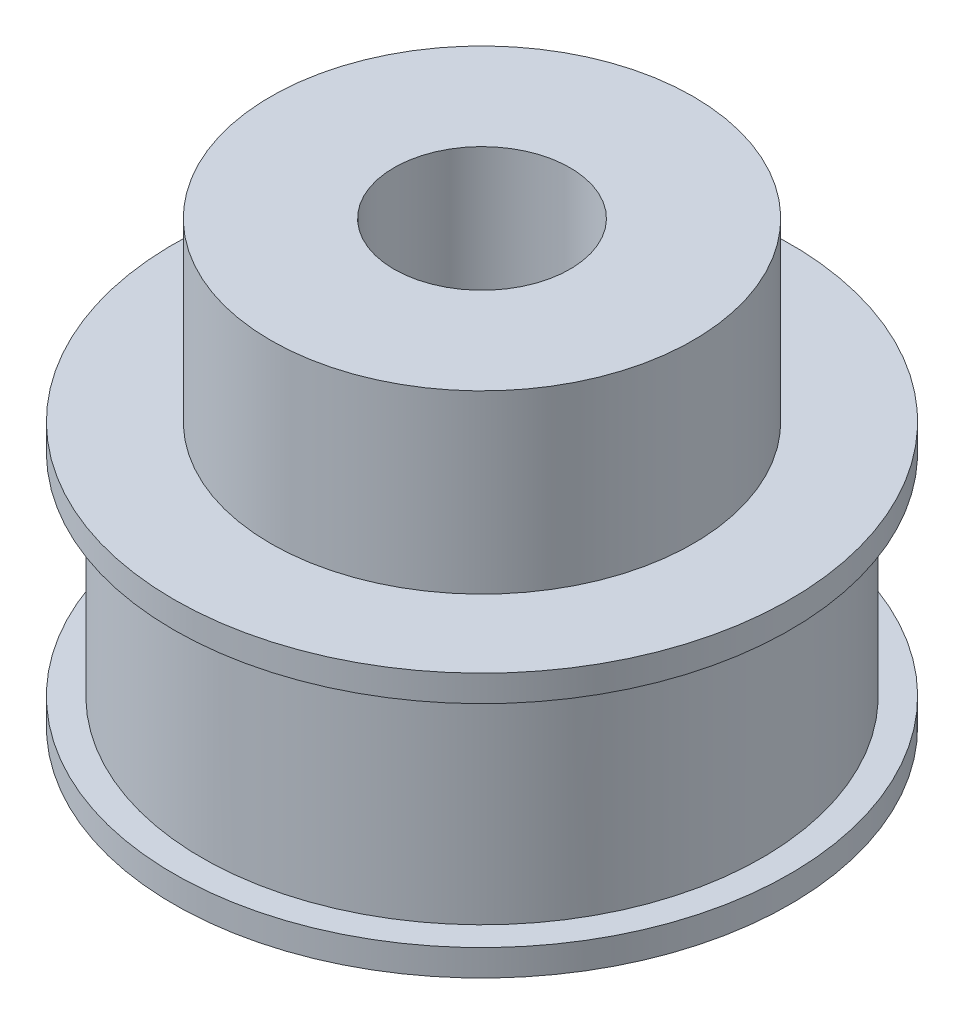
ISO-10303-21;
HEADER;
FILE_DESCRIPTION(('STEP AP214'),'2;1');
FILE_NAME('part.step','',(''),(''),'','','');
FILE_SCHEMA(('AUTOMOTIVE_DESIGN { 1 0 10303 214 1 1 1 1 }'));
ENDSEC;
DATA;
#1=APPLICATION_CONTEXT('core data for automotive mechanical design processes');
#2=APPLICATION_PROTOCOL_DEFINITION('international standard','automotive_design',2000,#1);
#3=PRODUCT_CONTEXT('',#1,'mechanical');
#4=PRODUCT('Part','Part','',(#3));
#5=PRODUCT_RELATED_PRODUCT_CATEGORY('part','',(#4));
#6=PRODUCT_DEFINITION_FORMATION('','',#4);
#7=PRODUCT_DEFINITION_CONTEXT('part definition',#1,'design');
#8=PRODUCT_DEFINITION('design','',#6,#7);
#9=PRODUCT_DEFINITION_SHAPE('','',#8);
#10=(LENGTH_UNIT() NAMED_UNIT(*) SI_UNIT(.MILLI.,.METRE.));
#11=(NAMED_UNIT(*) PLANE_ANGLE_UNIT() SI_UNIT($,.RADIAN.));
#12=(NAMED_UNIT(*) SI_UNIT($,.STERADIAN.) SOLID_ANGLE_UNIT());
#13=UNCERTAINTY_MEASURE_WITH_UNIT(LENGTH_MEASURE(1.E-05),#10,'distance_accuracy_value','');
#14=(GEOMETRIC_REPRESENTATION_CONTEXT(3) GLOBAL_UNCERTAINTY_ASSIGNED_CONTEXT((#13)) GLOBAL_UNIT_ASSIGNED_CONTEXT((#10,
#11,#12)) REPRESENTATION_CONTEXT('',''));
#15=CARTESIAN_POINT('',(0.,0.,0.));
#16=DIRECTION('',(0.,0.,1.));
#17=DIRECTION('',(1.,0.,0.));
#18=AXIS2_PLACEMENT_3D('',#15,#16,#17);
#19=CARTESIAN_POINT('',(0.,15.,0.));
#20=DIRECTION('',(0.,-1.,0.));
#21=DIRECTION('',(0.,0.,-1.));
#22=AXIS2_PLACEMENT_3D('',#19,#20,#21);
#23=CYLINDRICAL_SURFACE('',#22,15.915);
#24=CARTESIAN_POINT('',(0.,1.5,0.));
#25=DIRECTION('',(0.,-1.,0.));
#26=DIRECTION('',(0.,0.,-1.));
#27=AXIS2_PLACEMENT_3D('',#24,#25,#26);
#28=CIRCLE('',#27,15.915);
#29=CARTESIAN_POINT('',(0.,1.5,-15.915));
#30=VERTEX_POINT('',#29);
#31=EDGE_CURVE('E64',#30,#30,#28,.T.);
#32=ORIENTED_EDGE('',*,*,#31,.F.);
#33=EDGE_LOOP('',(#32));
#34=FACE_BOUND('',#33,.T.);
#35=CARTESIAN_POINT('',(0.,13.5,0.));
#36=DIRECTION('',(0.,1.,0.));
#37=DIRECTION('',(0.,0.,1.));
#38=AXIS2_PLACEMENT_3D('',#35,#36,#37);
#39=CIRCLE('',#38,15.915);
#40=CARTESIAN_POINT('',(0.,13.5,15.915));
#41=VERTEX_POINT('',#40);
#42=EDGE_CURVE('E76',#41,#41,#39,.T.);
#43=ORIENTED_EDGE('',*,*,#42,.F.);
#44=EDGE_LOOP('',(#43));
#45=FACE_BOUND('',#44,.T.);
#46=ADVANCED_FACE('F37',(#34,#45),#23,.T.);
#47=CARTESIAN_POINT('',(0.,15.,0.));
#48=DIRECTION('',(0.,1.,0.));
#49=DIRECTION('',(0.,0.,1.));
#50=AXIS2_PLACEMENT_3D('',#47,#48,#49);
#51=PLANE('',#50);
#52=CARTESIAN_POINT('',(0.,15.,0.));
#53=DIRECTION('',(0.,1.,0.));
#54=DIRECTION('',(0.,0.,1.));
#55=AXIS2_PLACEMENT_3D('',#52,#53,#54);
#56=CIRCLE('',#55,12.);
#57=CARTESIAN_POINT('',(0.,15.,12.));
#58=VERTEX_POINT('',#57);
#59=EDGE_CURVE('E41',#58,#58,#56,.T.);
#60=ORIENTED_EDGE('',*,*,#59,.F.);
#61=EDGE_LOOP('',(#60));
#62=FACE_BOUND('',#61,.T.);
#63=CARTESIAN_POINT('',(0.,15.,0.));
#64=DIRECTION('',(0.,1.,0.));
#65=DIRECTION('',(0.,0.,1.));
#66=AXIS2_PLACEMENT_3D('',#63,#64,#65);
#67=CIRCLE('',#66,17.5);
#68=CARTESIAN_POINT('',(0.,15.,17.5));
#69=VERTEX_POINT('',#68);
#70=EDGE_CURVE('E72',#69,#69,#67,.T.);
#71=ORIENTED_EDGE('',*,*,#70,.T.);
#72=EDGE_LOOP('',(#71));
#73=FACE_BOUND('',#72,.T.);
#74=ADVANCED_FACE('F88',(#62,#73),#51,.T.);
#75=CARTESIAN_POINT('',(0.,0.,0.));
#76=DIRECTION('',(0.,1.,0.));
#77=DIRECTION('',(0.,0.,1.));
#78=AXIS2_PLACEMENT_3D('',#75,#76,#77);
#79=PLANE('',#78);
#80=CARTESIAN_POINT('',(0.,0.,0.));
#81=DIRECTION('',(0.,1.,0.));
#82=DIRECTION('',(0.,0.,1.));
#83=AXIS2_PLACEMENT_3D('',#80,#81,#82);
#84=CIRCLE('',#83,5.);
#85=CARTESIAN_POINT('',(0.,0.,5.));
#86=VERTEX_POINT('',#85);
#87=EDGE_CURVE('E50',#86,#86,#84,.T.);
#88=ORIENTED_EDGE('',*,*,#87,.T.);
#89=EDGE_LOOP('',(#88));
#90=FACE_BOUND('',#89,.T.);
#91=CARTESIAN_POINT('',(0.,0.,0.));
#92=DIRECTION('',(0.,-1.,0.));
#93=DIRECTION('',(0.,0.,-1.));
#94=AXIS2_PLACEMENT_3D('',#91,#92,#93);
#95=CIRCLE('',#94,17.5);
#96=CARTESIAN_POINT('',(0.,0.,-17.5));
#97=VERTEX_POINT('',#96);
#98=EDGE_CURVE('E60',#97,#97,#95,.T.);
#99=ORIENTED_EDGE('',*,*,#98,.T.);
#100=EDGE_LOOP('',(#99));
#101=FACE_BOUND('',#100,.T.);
#102=ADVANCED_FACE('F39',(#90,#101),#79,.F.);
#103=CARTESIAN_POINT('',(0.,25.,0.));
#104=DIRECTION('',(0.,-1.,0.));
#105=DIRECTION('',(0.,0.,-1.));
#106=AXIS2_PLACEMENT_3D('',#103,#104,#105);
#107=CYLINDRICAL_SURFACE('',#106,12.);
#108=CARTESIAN_POINT('',(0.,25.,0.));
#109=DIRECTION('',(0.,1.,0.));
#110=DIRECTION('',(0.,0.,1.));
#111=AXIS2_PLACEMENT_3D('',#108,#109,#110);
#112=CIRCLE('',#111,12.);
#113=CARTESIAN_POINT('',(0.,25.,12.));
#114=VERTEX_POINT('',#113);
#115=EDGE_CURVE('E10',#114,#114,#112,.T.);
#116=ORIENTED_EDGE('',*,*,#115,.F.);
#117=EDGE_LOOP('',(#116));
#118=FACE_BOUND('',#117,.T.);
#119=ORIENTED_EDGE('',*,*,#59,.T.);
#120=EDGE_LOOP('',(#119));
#121=FACE_BOUND('',#120,.T.);
#122=ADVANCED_FACE('F107',(#118,#121),#107,.T.);
#123=CARTESIAN_POINT('',(0.,25.,0.));
#124=DIRECTION('',(0.,1.,0.));
#125=DIRECTION('',(0.,0.,1.));
#126=AXIS2_PLACEMENT_3D('',#123,#124,#125);
#127=PLANE('',#126);
#128=CARTESIAN_POINT('',(0.,25.,0.));
#129=DIRECTION('',(0.,1.,0.));
#130=DIRECTION('',(0.,0.,1.));
#131=AXIS2_PLACEMENT_3D('',#128,#129,#130);
#132=CIRCLE('',#131,5.);
#133=CARTESIAN_POINT('',(0.,25.,5.));
#134=VERTEX_POINT('',#133);
#135=EDGE_CURVE('E55',#134,#134,#132,.T.);
#136=ORIENTED_EDGE('',*,*,#135,.F.);
#137=EDGE_LOOP('',(#136));
#138=FACE_BOUND('',#137,.T.);
#139=ORIENTED_EDGE('',*,*,#115,.T.);
#140=EDGE_LOOP('',(#139));
#141=FACE_BOUND('',#140,.T.);
#142=ADVANCED_FACE('F103',(#138,#141),#127,.T.);
#143=CARTESIAN_POINT('',(0.,-0.999999999999997,0.));
#144=DIRECTION('',(0.,1.,0.));
#145=DIRECTION('',(0.,0.,1.));
#146=AXIS2_PLACEMENT_3D('',#143,#144,#145);
#147=CYLINDRICAL_SURFACE('',#146,5.);
#148=ORIENTED_EDGE('',*,*,#135,.T.);
#149=EDGE_LOOP('',(#148));
#150=FACE_BOUND('',#149,.T.);
#151=ORIENTED_EDGE('',*,*,#87,.F.);
#152=EDGE_LOOP('',(#151));
#153=FACE_BOUND('',#152,.T.);
#154=ADVANCED_FACE('F100',(#150,#153),#147,.F.);
#155=CARTESIAN_POINT('',(0.,1.5,0.));
#156=DIRECTION('',(0.,-1.,0.));
#157=DIRECTION('',(0.,0.,-1.));
#158=AXIS2_PLACEMENT_3D('',#155,#156,#157);
#159=CYLINDRICAL_SURFACE('',#158,17.5);
#160=CARTESIAN_POINT('',(0.,1.5,0.));
#161=DIRECTION('',(0.,-1.,0.));
#162=DIRECTION('',(0.,0.,-1.));
#163=AXIS2_PLACEMENT_3D('',#160,#161,#162);
#164=CIRCLE('',#163,17.5);
#165=CARTESIAN_POINT('',(0.,1.5,-17.5));
#166=VERTEX_POINT('',#165);
#167=EDGE_CURVE('E59',#166,#166,#164,.T.);
#168=ORIENTED_EDGE('',*,*,#167,.T.);
#169=EDGE_LOOP('',(#168));
#170=FACE_BOUND('',#169,.T.);
#171=ORIENTED_EDGE('',*,*,#98,.F.);
#172=EDGE_LOOP('',(#171));
#173=FACE_BOUND('',#172,.T.);
#174=ADVANCED_FACE('F98',(#170,#173),#159,.T.);
#175=CARTESIAN_POINT('',(0.,1.5,0.));
#176=DIRECTION('',(0.,-1.,0.));
#177=DIRECTION('',(0.,0.,-1.));
#178=AXIS2_PLACEMENT_3D('',#175,#176,#177);
#179=PLANE('',#178);
#180=ORIENTED_EDGE('',*,*,#31,.T.);
#181=EDGE_LOOP('',(#180));
#182=FACE_BOUND('',#181,.T.);
#183=ORIENTED_EDGE('',*,*,#167,.F.);
#184=EDGE_LOOP('',(#183));
#185=FACE_BOUND('',#184,.T.);
#186=ADVANCED_FACE('F122',(#182,#185),#179,.F.);
#187=CARTESIAN_POINT('',(0.,13.5,0.));
#188=DIRECTION('',(0.,1.,0.));
#189=DIRECTION('',(0.,0.,1.));
#190=AXIS2_PLACEMENT_3D('',#187,#188,#189);
#191=CYLINDRICAL_SURFACE('',#190,17.5);
#192=CARTESIAN_POINT('',(0.,13.5,0.));
#193=DIRECTION('',(0.,1.,0.));
#194=DIRECTION('',(0.,0.,1.));
#195=AXIS2_PLACEMENT_3D('',#192,#193,#194);
#196=CIRCLE('',#195,17.5);
#197=CARTESIAN_POINT('',(0.,13.5,17.5));
#198=VERTEX_POINT('',#197);
#199=EDGE_CURVE('E71',#198,#198,#196,.T.);
#200=ORIENTED_EDGE('',*,*,#199,.T.);
#201=EDGE_LOOP('',(#200));
#202=FACE_BOUND('',#201,.T.);
#203=ORIENTED_EDGE('',*,*,#70,.F.);
#204=EDGE_LOOP('',(#203));
#205=FACE_BOUND('',#204,.T.);
#206=ADVANCED_FACE('F120',(#202,#205),#191,.T.);
#207=CARTESIAN_POINT('',(0.,13.5,0.));
#208=DIRECTION('',(0.,1.,0.));
#209=DIRECTION('',(0.,0.,1.));
#210=AXIS2_PLACEMENT_3D('',#207,#208,#209);
#211=PLANE('',#210);
#212=ORIENTED_EDGE('',*,*,#42,.T.);
#213=EDGE_LOOP('',(#212));
#214=FACE_BOUND('',#213,.T.);
#215=ORIENTED_EDGE('',*,*,#199,.F.);
#216=EDGE_LOOP('',(#215));
#217=FACE_BOUND('',#216,.T.);
#218=ADVANCED_FACE('F84',(#214,#217),#211,.F.);
#219=CLOSED_SHELL('',(#46,#74,#102,#122,#142,#154,#174,#186,#206,#218));
#220=MANIFOLD_SOLID_BREP('B2',#219);
#221=ADVANCED_BREP_SHAPE_REPRESENTATION('',(#18,#220),#14);
#222=SHAPE_DEFINITION_REPRESENTATION(#9,#221);
ENDSEC;
END-ISO-10303-21;
